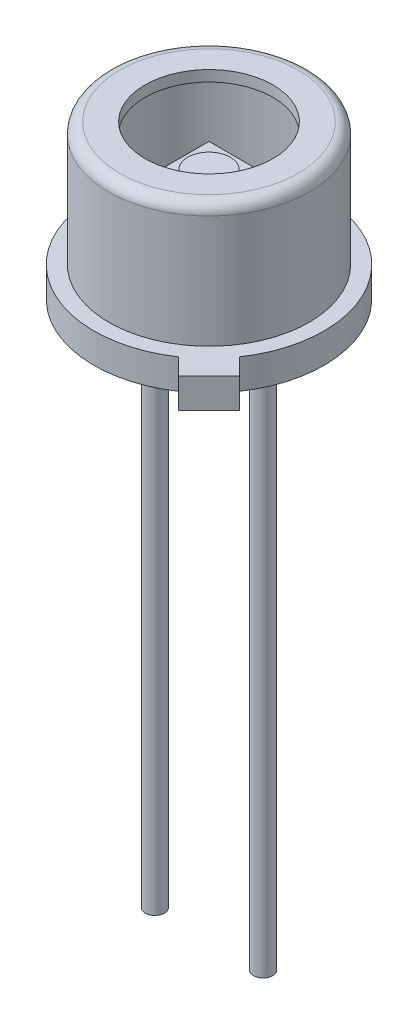
ISO-10303-21;
HEADER;
FILE_DESCRIPTION(('STEP AP214'),'2;1');
FILE_NAME('part.step','',(''),(''),'','','');
FILE_SCHEMA(('AUTOMOTIVE_DESIGN { 1 0 10303 214 1 1 1 1 }'));
ENDSEC;
DATA;
#1=APPLICATION_CONTEXT('core data for automotive mechanical design processes');
#2=APPLICATION_PROTOCOL_DEFINITION('international standard','automotive_design',2000,#1);
#3=PRODUCT_CONTEXT('',#1,'mechanical');
#4=PRODUCT('Part','Part','',(#3));
#5=PRODUCT_RELATED_PRODUCT_CATEGORY('part','',(#4));
#6=PRODUCT_DEFINITION_FORMATION('','',#4);
#7=PRODUCT_DEFINITION_CONTEXT('part definition',#1,'design');
#8=PRODUCT_DEFINITION('design','',#6,#7);
#9=PRODUCT_DEFINITION_SHAPE('','',#8);
#10=(LENGTH_UNIT() NAMED_UNIT(*) SI_UNIT(.MILLI.,.METRE.));
#11=(NAMED_UNIT(*) PLANE_ANGLE_UNIT() SI_UNIT($,.RADIAN.));
#12=(NAMED_UNIT(*) SI_UNIT($,.STERADIAN.) SOLID_ANGLE_UNIT());
#13=UNCERTAINTY_MEASURE_WITH_UNIT(LENGTH_MEASURE(1.E-05),#10,'distance_accuracy_value','');
#14=(GEOMETRIC_REPRESENTATION_CONTEXT(3) GLOBAL_UNCERTAINTY_ASSIGNED_CONTEXT((#13)) GLOBAL_UNIT_ASSIGNED_CONTEXT((#10,
#11,#12)) REPRESENTATION_CONTEXT('',''));
#15=CARTESIAN_POINT('',(0.,0.,0.));
#16=DIRECTION('',(0.,0.,1.));
#17=DIRECTION('',(1.,0.,0.));
#18=AXIS2_PLACEMENT_3D('',#15,#16,#17);
#19=CARTESIAN_POINT('',(-0.6,2.6,-0.6));
#20=DIRECTION('',(0.,-1.,0.));
#21=DIRECTION('',(0.,0.,-1.));
#22=AXIS2_PLACEMENT_3D('',#19,#20,#21);
#23=PLANE('',#22);
#24=DIRECTION('',(0.,0.,-1.));
#25=VECTOR('',#24,1.);
#26=CARTESIAN_POINT('',(-0.6,2.6,0.6));
#27=LINE('',#26,#25);
#28=CARTESIAN_POINT('',(-0.6,2.6,0.6));
#29=VERTEX_POINT('',#28);
#30=CARTESIAN_POINT('',(-0.6,2.6,-0.6));
#31=VERTEX_POINT('',#30);
#32=EDGE_CURVE('E124',#29,#31,#27,.T.);
#33=ORIENTED_EDGE('',*,*,#32,.F.);
#34=DIRECTION('',(-1.,0.,0.));
#35=VECTOR('',#34,1.);
#36=CARTESIAN_POINT('',(-0.6,2.6,0.6));
#37=LINE('',#36,#35);
#38=CARTESIAN_POINT('',(0.6,2.6,0.6));
#39=VERTEX_POINT('',#38);
#40=EDGE_CURVE('E97',#39,#29,#37,.T.);
#41=ORIENTED_EDGE('',*,*,#40,.F.);
#42=DIRECTION('',(0.,0.,1.));
#43=VECTOR('',#42,1.);
#44=CARTESIAN_POINT('',(0.6,2.6,0.6));
#45=LINE('',#44,#43);
#46=CARTESIAN_POINT('',(0.6,2.6,-0.6));
#47=VERTEX_POINT('',#46);
#48=EDGE_CURVE('E91',#47,#39,#45,.T.);
#49=ORIENTED_EDGE('',*,*,#48,.F.);
#50=DIRECTION('',(1.,0.,0.));
#51=VECTOR('',#50,1.);
#52=CARTESIAN_POINT('',(-0.6,2.6,-0.6));
#53=LINE('',#52,#51);
#54=EDGE_CURVE('E115',#31,#47,#53,.T.);
#55=ORIENTED_EDGE('',*,*,#54,.F.);
#56=EDGE_LOOP('',(#33,#41,#49,#55));
#57=FACE_BOUND('',#56,.T.);
#58=CARTESIAN_POINT('',(0.,2.6,0.));
#59=DIRECTION('',(0.,-1.,0.));
#60=DIRECTION('',(0.,0.,-1.));
#61=AXIS2_PLACEMENT_3D('',#58,#59,#60);
#62=CIRCLE('',#61,0.5);
#63=CARTESIAN_POINT('',(0.,2.6,-0.5));
#64=VERTEX_POINT('',#63);
#65=EDGE_CURVE('E12',#64,#64,#62,.F.);
#66=ORIENTED_EDGE('',*,*,#65,.F.);
#67=EDGE_LOOP('',(#66));
#68=FACE_BOUND('',#67,.T.);
#69=ADVANCED_FACE('F57',(#57,#68),#23,.F.);
#70=CARTESIAN_POINT('',(-0.6,2.55,0.6));
#71=DIRECTION('',(1.,0.,0.));
#72=DIRECTION('',(0.,0.,-1.));
#73=AXIS2_PLACEMENT_3D('',#70,#71,#72);
#74=PLANE('',#73);
#75=ORIENTED_EDGE('',*,*,#32,.T.);
#76=DIRECTION('',(0.,1.,0.));
#77=VECTOR('',#76,1.);
#78=CARTESIAN_POINT('',(-0.6,2.55,-0.6));
#79=LINE('',#78,#77);
#80=CARTESIAN_POINT('',(-0.6,2.55,-0.6));
#81=VERTEX_POINT('',#80);
#82=EDGE_CURVE('E66',#81,#31,#79,.T.);
#83=ORIENTED_EDGE('',*,*,#82,.F.);
#84=DIRECTION('',(0.,0.,-1.));
#85=VECTOR('',#84,1.);
#86=CARTESIAN_POINT('',(-0.6,2.55,0.6));
#87=LINE('',#86,#85);
#88=CARTESIAN_POINT('',(-0.6,2.55,0.6));
#89=VERTEX_POINT('',#88);
#90=EDGE_CURVE('E110',#89,#81,#87,.T.);
#91=ORIENTED_EDGE('',*,*,#90,.F.);
#92=DIRECTION('',(0.,1.,0.));
#93=VECTOR('',#92,1.);
#94=CARTESIAN_POINT('',(-0.6,2.55,0.6));
#95=LINE('',#94,#93);
#96=EDGE_CURVE('E120',#89,#29,#95,.T.);
#97=ORIENTED_EDGE('',*,*,#96,.T.);
#98=EDGE_LOOP('',(#75,#83,#91,#97));
#99=FACE_BOUND('',#98,.T.);
#100=ADVANCED_FACE('F59',(#99),#74,.F.);
#101=CARTESIAN_POINT('',(-0.6,2.55,-0.6));
#102=DIRECTION('',(0.,0.,1.));
#103=DIRECTION('',(1.,0.,0.));
#104=AXIS2_PLACEMENT_3D('',#101,#102,#103);
#105=PLANE('',#104);
#106=ORIENTED_EDGE('',*,*,#54,.T.);
#107=DIRECTION('',(0.,1.,0.));
#108=VECTOR('',#107,1.);
#109=CARTESIAN_POINT('',(0.6,2.55,-0.6));
#110=LINE('',#109,#108);
#111=CARTESIAN_POINT('',(0.6,2.55,-0.6));
#112=VERTEX_POINT('',#111);
#113=EDGE_CURVE('E113',#112,#47,#110,.T.);
#114=ORIENTED_EDGE('',*,*,#113,.F.);
#115=DIRECTION('',(1.,0.,0.));
#116=VECTOR('',#115,1.);
#117=CARTESIAN_POINT('',(-0.6,2.55,-0.6));
#118=LINE('',#117,#116);
#119=EDGE_CURVE('E105',#81,#112,#118,.T.);
#120=ORIENTED_EDGE('',*,*,#119,.F.);
#121=ORIENTED_EDGE('',*,*,#82,.T.);
#122=EDGE_LOOP('',(#106,#114,#120,#121));
#123=FACE_BOUND('',#122,.T.);
#124=ADVANCED_FACE('F114',(#123),#105,.F.);
#125=CARTESIAN_POINT('',(0.6,2.55,0.6));
#126=DIRECTION('',(-1.,0.,0.));
#127=DIRECTION('',(0.,0.,1.));
#128=AXIS2_PLACEMENT_3D('',#125,#126,#127);
#129=PLANE('',#128);
#130=ORIENTED_EDGE('',*,*,#48,.T.);
#131=DIRECTION('',(0.,1.,0.));
#132=VECTOR('',#131,1.);
#133=CARTESIAN_POINT('',(0.6,2.55,0.6));
#134=LINE('',#133,#132);
#135=CARTESIAN_POINT('',(0.6,2.55,0.6));
#136=VERTEX_POINT('',#135);
#137=EDGE_CURVE('E116',#136,#39,#134,.T.);
#138=ORIENTED_EDGE('',*,*,#137,.F.);
#139=DIRECTION('',(0.,0.,1.));
#140=VECTOR('',#139,1.);
#141=CARTESIAN_POINT('',(0.6,2.55,0.6));
#142=LINE('',#141,#140);
#143=EDGE_CURVE('E108',#112,#136,#142,.T.);
#144=ORIENTED_EDGE('',*,*,#143,.F.);
#145=ORIENTED_EDGE('',*,*,#113,.T.);
#146=EDGE_LOOP('',(#130,#138,#144,#145));
#147=FACE_BOUND('',#146,.T.);
#148=ADVANCED_FACE('F118',(#147),#129,.F.);
#149=CARTESIAN_POINT('',(-0.6,2.55,0.6));
#150=DIRECTION('',(0.,0.,-1.));
#151=DIRECTION('',(-1.,0.,0.));
#152=AXIS2_PLACEMENT_3D('',#149,#150,#151);
#153=PLANE('',#152);
#154=ORIENTED_EDGE('',*,*,#40,.T.);
#155=ORIENTED_EDGE('',*,*,#96,.F.);
#156=DIRECTION('',(-1.,0.,0.));
#157=VECTOR('',#156,1.);
#158=CARTESIAN_POINT('',(-0.6,2.55,0.6));
#159=LINE('',#158,#157);
#160=EDGE_CURVE('E74',#136,#89,#159,.T.);
#161=ORIENTED_EDGE('',*,*,#160,.F.);
#162=ORIENTED_EDGE('',*,*,#137,.T.);
#163=EDGE_LOOP('',(#154,#155,#161,#162));
#164=FACE_BOUND('',#163,.T.);
#165=ADVANCED_FACE('F151',(#164),#153,.F.);
#166=CARTESIAN_POINT('',(-0.6,2.55,-0.6));
#167=DIRECTION('',(0.,-1.,0.));
#168=DIRECTION('',(0.,0.,-1.));
#169=AXIS2_PLACEMENT_3D('',#166,#167,#168);
#170=PLANE('',#169);
#171=ORIENTED_EDGE('',*,*,#90,.T.);
#172=ORIENTED_EDGE('',*,*,#119,.T.);
#173=ORIENTED_EDGE('',*,*,#143,.T.);
#174=ORIENTED_EDGE('',*,*,#160,.T.);
#175=EDGE_LOOP('',(#171,#172,#173,#174));
#176=FACE_BOUND('',#175,.T.);
#177=ADVANCED_FACE('F106',(#176),#170,.T.);
#178=CARTESIAN_POINT('',(0.,2.63,0.));
#179=DIRECTION('',(0.,-1.,0.));
#180=DIRECTION('',(0.,0.,-1.));
#181=AXIS2_PLACEMENT_3D('',#178,#179,#180);
#182=CYLINDRICAL_SURFACE('',#181,0.5);
#183=CARTESIAN_POINT('',(0.,2.63,0.));
#184=DIRECTION('',(0.,1.,0.));
#185=DIRECTION('',(0.,0.,1.));
#186=AXIS2_PLACEMENT_3D('',#183,#184,#185);
#187=CIRCLE('',#186,0.5);
#188=CARTESIAN_POINT('',(0.,2.63,0.5));
#189=VERTEX_POINT('',#188);
#190=EDGE_CURVE('E127',#189,#189,#187,.T.);
#191=ORIENTED_EDGE('',*,*,#190,.F.);
#192=EDGE_LOOP('',(#191));
#193=FACE_BOUND('',#192,.T.);
#194=ORIENTED_EDGE('',*,*,#65,.T.);
#195=EDGE_LOOP('',(#194));
#196=FACE_BOUND('',#195,.T.);
#197=ADVANCED_FACE('F140',(#193,#196),#182,.T.);
#198=CARTESIAN_POINT('',(0.,2.63,0.));
#199=DIRECTION('',(0.,1.,0.));
#200=DIRECTION('',(0.,0.,1.));
#201=AXIS2_PLACEMENT_3D('',#198,#199,#200);
#202=PLANE('',#201);
#203=ORIENTED_EDGE('',*,*,#190,.T.);
#204=EDGE_LOOP('',(#203));
#205=FACE_BOUND('',#204,.T.);
#206=ADVANCED_FACE('F142',(#205),#202,.T.);
#207=CLOSED_SHELL('',(#69,#100,#124,#148,#165,#177,#197,#206));
#208=MANIFOLD_SOLID_BREP('B2',#207);
#209=CARTESIAN_POINT('',(2.7,0.,0.));
#210=DIRECTION('',(0.,1.,0.));
#211=DIRECTION('',(0.,0.,1.));
#212=AXIS2_PLACEMENT_3D('',#209,#210,#211);
#213=PLANE('',#212);
#214=CARTESIAN_POINT('',(1.27,0.,0.));
#215=DIRECTION('',(0.,-1.,0.));
#216=DIRECTION('',(0.,0.,-1.));
#217=AXIS2_PLACEMENT_3D('',#214,#215,#216);
#218=CIRCLE('',#217,0.225);
#219=CARTESIAN_POINT('',(1.27,0.,-0.225));
#220=VERTEX_POINT('',#219);
#221=EDGE_CURVE('E409',#220,#220,#218,.F.);
#222=ORIENTED_EDGE('',*,*,#221,.T.);
#223=EDGE_LOOP('',(#222));
#224=FACE_BOUND('',#223,.T.);
#225=CARTESIAN_POINT('',(-1.27,0.,0.));
#226=DIRECTION('',(0.,1.,0.));
#227=DIRECTION('',(0.,0.,1.));
#228=AXIS2_PLACEMENT_3D('',#225,#226,#227);
#229=CIRCLE('',#228,0.225);
#230=CARTESIAN_POINT('',(-1.27,0.,0.225));
#231=VERTEX_POINT('',#230);
#232=EDGE_CURVE('E227',#231,#231,#229,.F.);
#233=ORIENTED_EDGE('',*,*,#232,.F.);
#234=EDGE_LOOP('',(#233));
#235=FACE_BOUND('',#234,.T.);
#236=CARTESIAN_POINT('',(0.,0.,0.));
#237=DIRECTION('',(0.,-1.,0.));
#238=DIRECTION('',(0.,0.,-1.));
#239=AXIS2_PLACEMENT_3D('',#236,#237,#238);
#240=CIRCLE('',#239,2.7);
#241=CARTESIAN_POINT('',(1.52028494861159,0.,2.23130761550824));
#242=VERTEX_POINT('',#241);
#243=CARTESIAN_POINT('',(2.23130761550823,0.,1.52028494861159));
#244=VERTEX_POINT('',#243);
#245=EDGE_CURVE('E287',#242,#244,#240,.T.);
#246=ORIENTED_EDGE('',*,*,#245,.T.);
#247=DIRECTION('',(0.707106781186553,0.,0.707106781186542));
#248=VECTOR('',#247,1.);
#249=CARTESIAN_POINT('',(2.23130761550823,0.,1.52028494861159));
#250=LINE('',#249,#248);
#251=CARTESIAN_POINT('',(2.61825303324528,0.,1.90723036634863));
#252=VERTEX_POINT('',#251);
#253=EDGE_CURVE('E272',#244,#252,#250,.T.);
#254=ORIENTED_EDGE('',*,*,#253,.T.);
#255=DIRECTION('',(-0.70710678118655,0.,0.707106781186545));
#256=VECTOR('',#255,1.);
#257=CARTESIAN_POINT('',(1.90723036634862,0.,2.61825303324527));
#258=LINE('',#257,#256);
#259=CARTESIAN_POINT('',(1.90723036634862,0.,2.61825303324527));
#260=VERTEX_POINT('',#259);
#261=EDGE_CURVE('E396',#252,#260,#258,.T.);
#262=ORIENTED_EDGE('',*,*,#261,.T.);
#263=DIRECTION('',(-0.707106781186538,0.,-0.707106781186556));
#264=VECTOR('',#263,1.);
#265=CARTESIAN_POINT('',(1.52028494861159,0.,2.23130761550823));
#266=LINE('',#265,#264);
#267=EDGE_CURVE('E234',#260,#242,#266,.T.);
#268=ORIENTED_EDGE('',*,*,#267,.T.);
#269=EDGE_LOOP('',(#246,#254,#262,#268));
#270=FACE_BOUND('',#269,.T.);
#271=CARTESIAN_POINT('',(0.,0.,-1.27));
#272=DIRECTION('',(0.,1.,0.));
#273=DIRECTION('',(0.,0.,1.));
#274=AXIS2_PLACEMENT_3D('',#271,#272,#273);
#275=CIRCLE('',#274,0.225);
#276=CARTESIAN_POINT('',(0.,0.,-1.045));
#277=VERTEX_POINT('',#276);
#278=EDGE_CURVE('E55',#277,#277,#275,.F.);
#279=ORIENTED_EDGE('',*,*,#278,.F.);
#280=EDGE_LOOP('',(#279));
#281=FACE_BOUND('',#280,.T.);
#282=ADVANCED_FACE('F219',(#224,#235,#270,#281),#213,.F.);
#283=CARTESIAN_POINT('',(2.096,3.6,0.));
#284=DIRECTION('',(0.,1.,0.));
#285=DIRECTION('',(0.,0.,1.));
#286=AXIS2_PLACEMENT_3D('',#283,#284,#285);
#287=PLANE('',#286);
#288=CARTESIAN_POINT('',(0.,3.6,0.));
#289=DIRECTION('',(0.,-1.,0.));
#290=DIRECTION('',(0.,0.,-1.));
#291=AXIS2_PLACEMENT_3D('',#288,#289,#290);
#292=CIRCLE('',#291,1.5);
#293=CARTESIAN_POINT('',(0.,3.6,-1.5));
#294=VERTEX_POINT('',#293);
#295=EDGE_CURVE('E302',#294,#294,#292,.T.);
#296=ORIENTED_EDGE('',*,*,#295,.T.);
#297=EDGE_LOOP('',(#296));
#298=FACE_BOUND('',#297,.T.);
#299=CARTESIAN_POINT('',(0.,3.6,0.));
#300=DIRECTION('',(0.,-1.,0.));
#301=DIRECTION('',(0.,0.,-1.));
#302=AXIS2_PLACEMENT_3D('',#299,#300,#301);
#303=CIRCLE('',#302,2.096);
#304=CARTESIAN_POINT('',(0.,3.6,-2.096));
#305=VERTEX_POINT('',#304);
#306=EDGE_CURVE('E383',#305,#305,#303,.T.);
#307=ORIENTED_EDGE('',*,*,#306,.F.);
#308=EDGE_LOOP('',(#307));
#309=FACE_BOUND('',#308,.T.);
#310=ADVANCED_FACE('F221',(#298,#309),#287,.T.);
#311=CARTESIAN_POINT('',(0.,0.,0.));
#312=DIRECTION('',(0.,-1.,0.));
#313=DIRECTION('',(0.,0.,-1.));
#314=AXIS2_PLACEMENT_3D('',#311,#312,#313);
#315=CYLINDRICAL_SURFACE('',#314,1.5);
#316=ORIENTED_EDGE('',*,*,#295,.F.);
#317=EDGE_LOOP('',(#316));
#318=FACE_BOUND('',#317,.T.);
#319=CARTESIAN_POINT('',(0.,3.346,0.));
#320=DIRECTION('',(0.,-1.,0.));
#321=DIRECTION('',(0.,0.,-1.));
#322=AXIS2_PLACEMENT_3D('',#319,#320,#321);
#323=CIRCLE('',#322,1.5);
#324=CARTESIAN_POINT('',(0.,3.346,-1.5));
#325=VERTEX_POINT('',#324);
#326=EDGE_CURVE('E299',#325,#325,#323,.T.);
#327=ORIENTED_EDGE('',*,*,#326,.T.);
#328=EDGE_LOOP('',(#327));
#329=FACE_BOUND('',#328,.T.);
#330=ADVANCED_FACE('F366',(#318,#329),#315,.F.);
#331=CARTESIAN_POINT('',(2.096,3.346,0.));
#332=DIRECTION('',(0.,1.,0.));
#333=DIRECTION('',(0.,0.,1.));
#334=AXIS2_PLACEMENT_3D('',#331,#332,#333);
#335=PLANE('',#334);
#336=ORIENTED_EDGE('',*,*,#326,.F.);
#337=EDGE_LOOP('',(#336));
#338=FACE_BOUND('',#337,.T.);
#339=CARTESIAN_POINT('',(0.,3.346,0.));
#340=DIRECTION('',(0.,-1.,0.));
#341=DIRECTION('',(0.,0.,-1.));
#342=AXIS2_PLACEMENT_3D('',#339,#340,#341);
#343=CIRCLE('',#342,2.096);
#344=CARTESIAN_POINT('',(0.,3.346,-2.096));
#345=VERTEX_POINT('',#344);
#346=EDGE_CURVE('E290',#345,#345,#343,.T.);
#347=ORIENTED_EDGE('',*,*,#346,.T.);
#348=EDGE_LOOP('',(#347));
#349=FACE_BOUND('',#348,.T.);
#350=ADVANCED_FACE('F363',(#338,#349),#335,.F.);
#351=CARTESIAN_POINT('',(0.,0.,0.));
#352=DIRECTION('',(0.,-1.,0.));
#353=DIRECTION('',(0.,0.,-1.));
#354=AXIS2_PLACEMENT_3D('',#351,#352,#353);
#355=CYLINDRICAL_SURFACE('',#354,2.096);
#356=ORIENTED_EDGE('',*,*,#346,.F.);
#357=EDGE_LOOP('',(#356));
#358=FACE_BOUND('',#357,.T.);
#359=CARTESIAN_POINT('',(0.,0.446,0.));
#360=DIRECTION('',(0.,1.,0.));
#361=DIRECTION('',(0.,0.,1.));
#362=AXIS2_PLACEMENT_3D('',#359,#360,#361);
#363=CIRCLE('',#362,2.096);
#364=CARTESIAN_POINT('',(0.,0.446,2.096));
#365=VERTEX_POINT('',#364);
#366=EDGE_CURVE('E382',#365,#365,#363,.F.);
#367=ORIENTED_EDGE('',*,*,#366,.T.);
#368=EDGE_LOOP('',(#367));
#369=FACE_BOUND('',#368,.T.);
#370=ADVANCED_FACE('F359',(#358,#369),#355,.F.);
#371=CARTESIAN_POINT('',(0.,0.,0.));
#372=DIRECTION('',(0.,-1.,0.));
#373=DIRECTION('',(0.,0.,-1.));
#374=AXIS2_PLACEMENT_3D('',#371,#372,#373);
#375=CYLINDRICAL_SURFACE('',#374,2.7);
#376=DIRECTION('',(0.,-1.,0.));
#377=VECTOR('',#376,1.);
#378=CARTESIAN_POINT('',(2.23130761550823,0.7,1.52028494861159));
#379=LINE('',#378,#377);
#380=CARTESIAN_POINT('',(2.23130761550823,0.7,1.52028494861159));
#381=VERTEX_POINT('',#380);
#382=EDGE_CURVE('E266',#381,#244,#379,.T.);
#383=ORIENTED_EDGE('',*,*,#382,.T.);
#384=ORIENTED_EDGE('',*,*,#245,.F.);
#385=DIRECTION('',(0.,-1.,0.));
#386=VECTOR('',#385,1.);
#387=CARTESIAN_POINT('',(1.52028494861159,0.7,2.23130761550823));
#388=LINE('',#387,#386);
#389=CARTESIAN_POINT('',(1.52028494861159,0.7,2.23130761550823));
#390=VERTEX_POINT('',#389);
#391=EDGE_CURVE('E277',#390,#242,#388,.T.);
#392=ORIENTED_EDGE('',*,*,#391,.F.);
#393=CARTESIAN_POINT('',(0.,0.7,0.));
#394=DIRECTION('',(0.,-1.,0.));
#395=DIRECTION('',(0.,0.,-1.));
#396=AXIS2_PLACEMENT_3D('',#393,#394,#395);
#397=CIRCLE('',#396,2.7);
#398=EDGE_CURVE('E283',#390,#381,#397,.T.);
#399=ORIENTED_EDGE('',*,*,#398,.T.);
#400=EDGE_LOOP('',(#383,#384,#392,#399));
#401=FACE_BOUND('',#400,.T.);
#402=ADVANCED_FACE('F286',(#401),#375,.T.);
#403=CARTESIAN_POINT('',(2.7,0.7,0.));
#404=DIRECTION('',(0.,1.,0.));
#405=DIRECTION('',(0.,0.,1.));
#406=AXIS2_PLACEMENT_3D('',#403,#404,#405);
#407=PLANE('',#406);
#408=ORIENTED_EDGE('',*,*,#398,.F.);
#409=DIRECTION('',(-0.707106781186538,0.,-0.707106781186556));
#410=VECTOR('',#409,1.);
#411=CARTESIAN_POINT('',(1.52028494861159,0.7,2.23130761550823));
#412=LINE('',#411,#410);
#413=CARTESIAN_POINT('',(1.90723036634862,0.7,2.61825303324527));
#414=VERTEX_POINT('',#413);
#415=EDGE_CURVE('E260',#414,#390,#412,.T.);
#416=ORIENTED_EDGE('',*,*,#415,.F.);
#417=DIRECTION('',(-0.70710678118655,0.,0.707106781186545));
#418=VECTOR('',#417,1.);
#419=CARTESIAN_POINT('',(1.90723036634862,0.7,2.61825303324527));
#420=LINE('',#419,#418);
#421=CARTESIAN_POINT('',(2.61825303324528,0.7,1.90723036634863));
#422=VERTEX_POINT('',#421);
#423=EDGE_CURVE('E284',#422,#414,#420,.T.);
#424=ORIENTED_EDGE('',*,*,#423,.F.);
#425=DIRECTION('',(0.707106781186553,0.,0.707106781186542));
#426=VECTOR('',#425,1.);
#427=CARTESIAN_POINT('',(2.23130761550823,0.7,1.52028494861159));
#428=LINE('',#427,#426);
#429=EDGE_CURVE('E269',#381,#422,#428,.T.);
#430=ORIENTED_EDGE('',*,*,#429,.F.);
#431=EDGE_LOOP('',(#408,#416,#424,#430));
#432=FACE_BOUND('',#431,.T.);
#433=CARTESIAN_POINT('',(0.,0.7,0.));
#434=DIRECTION('',(0.,-1.,0.));
#435=DIRECTION('',(0.,0.,-1.));
#436=AXIS2_PLACEMENT_3D('',#433,#434,#435);
#437=CIRCLE('',#436,2.35);
#438=CARTESIAN_POINT('',(0.,0.7,-2.35));
#439=VERTEX_POINT('',#438);
#440=EDGE_CURVE('E288',#439,#439,#437,.T.);
#441=ORIENTED_EDGE('',*,*,#440,.T.);
#442=EDGE_LOOP('',(#441));
#443=FACE_BOUND('',#442,.T.);
#444=ADVANCED_FACE('F281',(#432,#443),#407,.T.);
#445=CARTESIAN_POINT('',(0.,0.,0.));
#446=DIRECTION('',(0.,-1.,0.));
#447=DIRECTION('',(0.,0.,-1.));
#448=AXIS2_PLACEMENT_3D('',#445,#446,#447);
#449=CYLINDRICAL_SURFACE('',#448,2.35);
#450=CARTESIAN_POINT('',(0.,3.346,0.));
#451=DIRECTION('',(0.,-1.,0.));
#452=DIRECTION('',(0.,0.,-1.));
#453=AXIS2_PLACEMENT_3D('',#450,#451,#452);
#454=CIRCLE('',#453,2.35);
#455=CARTESIAN_POINT('',(0.,3.346,-2.35));
#456=VERTEX_POINT('',#455);
#457=EDGE_CURVE('E293',#456,#456,#454,.T.);
#458=ORIENTED_EDGE('',*,*,#457,.T.);
#459=EDGE_LOOP('',(#458));
#460=FACE_BOUND('',#459,.T.);
#461=ORIENTED_EDGE('',*,*,#440,.F.);
#462=EDGE_LOOP('',(#461));
#463=FACE_BOUND('',#462,.T.);
#464=ADVANCED_FACE('F351',(#460,#463),#449,.T.);
#465=CARTESIAN_POINT('',(0.,3.346,0.));
#466=DIRECTION('',(0.,-1.,0.));
#467=DIRECTION('',(0.,0.,-1.));
#468=AXIS2_PLACEMENT_3D('',#465,#466,#467);
#469=TOROIDAL_SURFACE('',#468,2.096,0.254);
#470=ORIENTED_EDGE('',*,*,#306,.T.);
#471=EDGE_LOOP('',(#470));
#472=FACE_BOUND('',#471,.T.);
#473=ORIENTED_EDGE('',*,*,#457,.F.);
#474=EDGE_LOOP('',(#473));
#475=FACE_BOUND('',#474,.T.);
#476=ADVANCED_FACE('F347',(#472,#475),#469,.T.);
#477=CARTESIAN_POINT('',(2.7,0.446,0.));
#478=DIRECTION('',(0.,1.,0.));
#479=DIRECTION('',(0.,0.,1.));
#480=AXIS2_PLACEMENT_3D('',#477,#478,#479);
#481=PLANE('',#480);
#482=ORIENTED_EDGE('',*,*,#366,.F.);
#483=EDGE_LOOP('',(#482));
#484=FACE_BOUND('',#483,.T.);
#485=ADVANCED_FACE('F344',(#484),#481,.T.);
#486=CARTESIAN_POINT('',(1.52028494861159,0.7,2.23130761550823));
#487=DIRECTION('',(-0.707106781186557,0.,0.707106781186539));
#488=DIRECTION('',(0.707106781186539,0.,0.707106781186557));
#489=AXIS2_PLACEMENT_3D('',#486,#487,#488);
#490=PLANE('',#489);
#491=ORIENTED_EDGE('',*,*,#267,.F.);
#492=DIRECTION('',(0.,-1.,0.));
#493=VECTOR('',#492,1.);
#494=CARTESIAN_POINT('',(1.90723036634862,0.7,2.61825303324527));
#495=LINE('',#494,#493);
#496=EDGE_CURVE('E242',#414,#260,#495,.T.);
#497=ORIENTED_EDGE('',*,*,#496,.F.);
#498=ORIENTED_EDGE('',*,*,#415,.T.);
#499=ORIENTED_EDGE('',*,*,#391,.T.);
#500=EDGE_LOOP('',(#491,#497,#498,#499));
#501=FACE_BOUND('',#500,.T.);
#502=ADVANCED_FACE('F339',(#501),#490,.T.);
#503=CARTESIAN_POINT('',(1.90723036634862,0.7,2.61825303324527));
#504=DIRECTION('',(0.707106781186545,0.,0.70710678118655));
#505=DIRECTION('',(0.70710678118655,0.,-0.707106781186545));
#506=AXIS2_PLACEMENT_3D('',#503,#504,#505);
#507=PLANE('',#506);
#508=ORIENTED_EDGE('',*,*,#261,.F.);
#509=DIRECTION('',(0.,-1.,0.));
#510=VECTOR('',#509,1.);
#511=CARTESIAN_POINT('',(2.61825303324528,0.7,1.90723036634863));
#512=LINE('',#511,#510);
#513=EDGE_CURVE('E276',#422,#252,#512,.T.);
#514=ORIENTED_EDGE('',*,*,#513,.F.);
#515=ORIENTED_EDGE('',*,*,#423,.T.);
#516=ORIENTED_EDGE('',*,*,#496,.T.);
#517=EDGE_LOOP('',(#508,#514,#515,#516));
#518=FACE_BOUND('',#517,.T.);
#519=ADVANCED_FACE('F336',(#518),#507,.T.);
#520=CARTESIAN_POINT('',(2.23130761550823,0.7,1.52028494861159));
#521=DIRECTION('',(0.707106781186542,0.,-0.707106781186553));
#522=DIRECTION('',(-0.707106781186553,0.,-0.707106781186542));
#523=AXIS2_PLACEMENT_3D('',#520,#521,#522);
#524=PLANE('',#523);
#525=ORIENTED_EDGE('',*,*,#253,.F.);
#526=ORIENTED_EDGE('',*,*,#382,.F.);
#527=ORIENTED_EDGE('',*,*,#429,.T.);
#528=ORIENTED_EDGE('',*,*,#513,.T.);
#529=EDGE_LOOP('',(#525,#526,#527,#528));
#530=FACE_BOUND('',#529,.T.);
#531=ADVANCED_FACE('F268',(#530),#524,.T.);
#532=CARTESIAN_POINT('',(-1.27,-13.,0.));
#533=DIRECTION('',(0.,1.,0.));
#534=DIRECTION('',(0.,0.,1.));
#535=AXIS2_PLACEMENT_3D('',#532,#533,#534);
#536=CYLINDRICAL_SURFACE('',#535,0.225);
#537=CARTESIAN_POINT('',(-1.27,-13.,0.));
#538=DIRECTION('',(0.,-1.,0.));
#539=DIRECTION('',(0.,0.,-1.));
#540=AXIS2_PLACEMENT_3D('',#537,#538,#539);
#541=CIRCLE('',#540,0.225);
#542=CARTESIAN_POINT('',(-1.27,-13.,-0.225));
#543=VERTEX_POINT('',#542);
#544=EDGE_CURVE('E400',#543,#543,#541,.T.);
#545=ORIENTED_EDGE('',*,*,#544,.F.);
#546=EDGE_LOOP('',(#545));
#547=FACE_BOUND('',#546,.T.);
#548=ORIENTED_EDGE('',*,*,#232,.T.);
#549=EDGE_LOOP('',(#548));
#550=FACE_BOUND('',#549,.T.);
#551=ADVANCED_FACE('F307',(#547,#550),#536,.T.);
#552=CARTESIAN_POINT('',(0.,-13.,0.));
#553=DIRECTION('',(0.,-1.,0.));
#554=DIRECTION('',(0.,0.,-1.));
#555=AXIS2_PLACEMENT_3D('',#552,#553,#554);
#556=PLANE('',#555);
#557=ORIENTED_EDGE('',*,*,#544,.T.);
#558=EDGE_LOOP('',(#557));
#559=FACE_BOUND('',#558,.T.);
#560=ADVANCED_FACE('F318',(#559),#556,.T.);
#561=CARTESIAN_POINT('',(0.,-13.,-1.27));
#562=DIRECTION('',(0.,1.,0.));
#563=DIRECTION('',(0.,0.,1.));
#564=AXIS2_PLACEMENT_3D('',#561,#562,#563);
#565=CYLINDRICAL_SURFACE('',#564,0.225);
#566=CARTESIAN_POINT('',(0.,-13.,-1.27));
#567=DIRECTION('',(0.,-1.,0.));
#568=DIRECTION('',(0.,0.,-1.));
#569=AXIS2_PLACEMENT_3D('',#566,#567,#568);
#570=CIRCLE('',#569,0.225);
#571=CARTESIAN_POINT('',(0.,-13.,-1.495));
#572=VERTEX_POINT('',#571);
#573=EDGE_CURVE('E405',#572,#572,#570,.T.);
#574=ORIENTED_EDGE('',*,*,#573,.F.);
#575=EDGE_LOOP('',(#574));
#576=FACE_BOUND('',#575,.T.);
#577=ORIENTED_EDGE('',*,*,#278,.T.);
#578=EDGE_LOOP('',(#577));
#579=FACE_BOUND('',#578,.T.);
#580=ADVANCED_FACE('F315',(#576,#579),#565,.T.);
#581=CARTESIAN_POINT('',(0.,-13.,0.));
#582=DIRECTION('',(0.,-1.,0.));
#583=DIRECTION('',(0.,0.,-1.));
#584=AXIS2_PLACEMENT_3D('',#581,#582,#583);
#585=PLANE('',#584);
#586=ORIENTED_EDGE('',*,*,#573,.T.);
#587=EDGE_LOOP('',(#586));
#588=FACE_BOUND('',#587,.T.);
#589=ADVANCED_FACE('F317',(#588),#585,.T.);
#590=CARTESIAN_POINT('',(1.27,-13.,0.));
#591=DIRECTION('',(0.,1.,0.));
#592=DIRECTION('',(0.,0.,1.));
#593=AXIS2_PLACEMENT_3D('',#590,#591,#592);
#594=CYLINDRICAL_SURFACE('',#593,0.225);
#595=CARTESIAN_POINT('',(1.27,-13.,0.));
#596=DIRECTION('',(0.,-1.,0.));
#597=DIRECTION('',(0.,0.,-1.));
#598=AXIS2_PLACEMENT_3D('',#595,#596,#597);
#599=CIRCLE('',#598,0.225);
#600=CARTESIAN_POINT('',(1.27,-13.,-0.225));
#601=VERTEX_POINT('',#600);
#602=EDGE_CURVE('E408',#601,#601,#599,.F.);
#603=ORIENTED_EDGE('',*,*,#602,.T.);
#604=EDGE_LOOP('',(#603));
#605=FACE_BOUND('',#604,.T.);
#606=ORIENTED_EDGE('',*,*,#221,.F.);
#607=EDGE_LOOP('',(#606));
#608=FACE_BOUND('',#607,.T.);
#609=ADVANCED_FACE('F325',(#605,#608),#594,.T.);
#610=CARTESIAN_POINT('',(0.,-13.,0.));
#611=DIRECTION('',(0.,-1.,0.));
#612=DIRECTION('',(0.,0.,-1.));
#613=AXIS2_PLACEMENT_3D('',#610,#611,#612);
#614=PLANE('',#613);
#615=ORIENTED_EDGE('',*,*,#602,.F.);
#616=EDGE_LOOP('',(#615));
#617=FACE_BOUND('',#616,.T.);
#618=ADVANCED_FACE('F417',(#617),#614,.T.);
#619=CLOSED_SHELL('',(#282,#310,#330,#350,#370,#402,#444,#464,#476,#485,#502,#519,#531,#551,
#560,#580,#589,#609,#618));
#620=MANIFOLD_SOLID_BREP('B6',#619);
#621=ADVANCED_BREP_SHAPE_REPRESENTATION('',(#18,#208,#620),#14);
#622=SHAPE_DEFINITION_REPRESENTATION(#9,#621);
ENDSEC;
END-ISO-10303-21;
